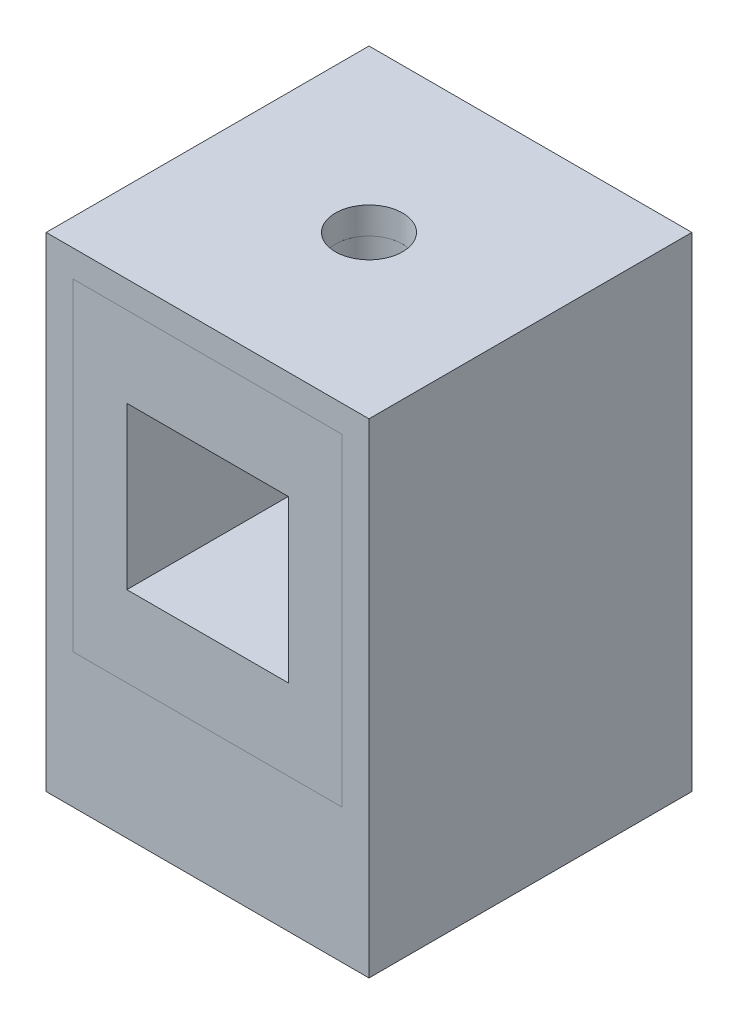
ISO-10303-21;
HEADER;
FILE_DESCRIPTION(('STEP AP214'),'2;1');
FILE_NAME('part.step','',(''),(''),'','','');
FILE_SCHEMA(('AUTOMOTIVE_DESIGN { 1 0 10303 214 1 1 1 1 }'));
ENDSEC;
DATA;
#1=APPLICATION_CONTEXT('core data for automotive mechanical design processes');
#2=APPLICATION_PROTOCOL_DEFINITION('international standard','automotive_design',2000,#1);
#3=PRODUCT_CONTEXT('',#1,'mechanical');
#4=PRODUCT('Part','Part','',(#3));
#5=PRODUCT_RELATED_PRODUCT_CATEGORY('part','',(#4));
#6=PRODUCT_DEFINITION_FORMATION('','',#4);
#7=PRODUCT_DEFINITION_CONTEXT('part definition',#1,'design');
#8=PRODUCT_DEFINITION('design','',#6,#7);
#9=PRODUCT_DEFINITION_SHAPE('','',#8);
#10=(LENGTH_UNIT() NAMED_UNIT(*) SI_UNIT(.MILLI.,.METRE.));
#11=(NAMED_UNIT(*) PLANE_ANGLE_UNIT() SI_UNIT($,.RADIAN.));
#12=(NAMED_UNIT(*) SI_UNIT($,.STERADIAN.) SOLID_ANGLE_UNIT());
#13=UNCERTAINTY_MEASURE_WITH_UNIT(LENGTH_MEASURE(1.E-05),#10,'distance_accuracy_value','');
#14=(GEOMETRIC_REPRESENTATION_CONTEXT(3) GLOBAL_UNCERTAINTY_ASSIGNED_CONTEXT((#13)) GLOBAL_UNIT_ASSIGNED_CONTEXT((#10,
#11,#12)) REPRESENTATION_CONTEXT('',''));
#15=CARTESIAN_POINT('',(0.,0.,0.));
#16=DIRECTION('',(0.,0.,1.));
#17=DIRECTION('',(1.,0.,0.));
#18=AXIS2_PLACEMENT_3D('',#15,#16,#17);
#19=CARTESIAN_POINT('',(-152.4,-457.2,-127.));
#20=DIRECTION('',(0.,0.,-1.));
#21=DIRECTION('',(-1.,0.,0.));
#22=AXIS2_PLACEMENT_3D('',#19,#20,#21);
#23=PLANE('',#22);
#24=DIRECTION('',(0.,-1.,0.));
#25=VECTOR('',#24,1.);
#26=CARTESIAN_POINT('',(-127.,-25.4,-127.));
#27=LINE('',#26,#25);
#28=CARTESIAN_POINT('',(-127.,-25.4,-127.00000000001));
#29=VERTEX_POINT('',#28);
#30=CARTESIAN_POINT('',(-127.,-330.2,-127.00000000001));
#31=VERTEX_POINT('',#30);
#32=EDGE_CURVE('E12',#29,#31,#27,.T.);
#33=ORIENTED_EDGE('',*,*,#32,.F.);
#34=DIRECTION('',(-1.,0.,0.));
#35=VECTOR('',#34,1.);
#36=CARTESIAN_POINT('',(-127.,-25.4,-127.));
#37=LINE('',#36,#35);
#38=CARTESIAN_POINT('',(127.,-25.4,-127.00000000001));
#39=VERTEX_POINT('',#38);
#40=EDGE_CURVE('E168',#39,#29,#37,.T.);
#41=ORIENTED_EDGE('',*,*,#40,.F.);
#42=DIRECTION('',(0.,1.,0.));
#43=VECTOR('',#42,1.);
#44=CARTESIAN_POINT('',(127.,-25.4,-127.));
#45=LINE('',#44,#43);
#46=CARTESIAN_POINT('',(127.,-330.2,-127.00000000001));
#47=VERTEX_POINT('',#46);
#48=EDGE_CURVE('E50',#47,#39,#45,.T.);
#49=ORIENTED_EDGE('',*,*,#48,.F.);
#50=DIRECTION('',(1.,0.,0.));
#51=VECTOR('',#50,1.);
#52=CARTESIAN_POINT('',(-127.,-330.2,-127.));
#53=LINE('',#52,#51);
#54=EDGE_CURVE('E55',#31,#47,#53,.T.);
#55=ORIENTED_EDGE('',*,*,#54,.F.);
#56=EDGE_LOOP('',(#33,#41,#49,#55));
#57=FACE_BOUND('',#56,.T.);
#58=ADVANCED_FACE('F47',(#57),#23,.T.);
#59=CARTESIAN_POINT('',(127.,-25.4,-500000.));
#60=DIRECTION('',(1.,0.,0.));
#61=DIRECTION('',(0.,0.,-1.));
#62=AXIS2_PLACEMENT_3D('',#59,#60,#61);
#63=PLANE('',#62);
#64=DIRECTION('',(0.,0.,1.));
#65=VECTOR('',#64,1.);
#66=CARTESIAN_POINT('',(127.,-330.2,-500000.));
#67=LINE('',#66,#65);
#68=CARTESIAN_POINT('',(127.,-330.2,152.4));
#69=VERTEX_POINT('',#68);
#70=EDGE_CURVE('E169',#47,#69,#67,.T.);
#71=ORIENTED_EDGE('',*,*,#70,.F.);
#72=ORIENTED_EDGE('',*,*,#48,.T.);
#73=DIRECTION('',(0.,0.,1.));
#74=VECTOR('',#73,1.);
#75=CARTESIAN_POINT('',(127.,-25.4,-500000.));
#76=LINE('',#75,#74);
#77=CARTESIAN_POINT('',(127.,-25.4,152.4));
#78=VERTEX_POINT('',#77);
#79=EDGE_CURVE('E171',#39,#78,#76,.T.);
#80=ORIENTED_EDGE('',*,*,#79,.T.);
#81=DIRECTION('',(0.,1.,0.));
#82=VECTOR('',#81,1.);
#83=CARTESIAN_POINT('',(127.,-25.4,152.4));
#84=LINE('',#83,#82);
#85=EDGE_CURVE('E157',#69,#78,#84,.T.);
#86=ORIENTED_EDGE('',*,*,#85,.F.);
#87=EDGE_LOOP('',(#71,#72,#80,#86));
#88=FACE_BOUND('',#87,.T.);
#89=ADVANCED_FACE('F179',(#88),#63,.T.);
#90=CARTESIAN_POINT('',(-127.,-330.2,152.4));
#91=DIRECTION('',(0.,0.,1.));
#92=DIRECTION('',(1.,0.,0.));
#93=AXIS2_PLACEMENT_3D('',#90,#91,#92);
#94=PLANE('',#93);
#95=DIRECTION('',(0.,-1.,0.));
#96=VECTOR('',#95,1.);
#97=CARTESIAN_POINT('',(-76.2,-254.,152.4));
#98=LINE('',#97,#96);
#99=CARTESIAN_POINT('',(-76.2,-101.6,152.4));
#100=VERTEX_POINT('',#99);
#101=CARTESIAN_POINT('',(-76.2,-254.,152.4));
#102=VERTEX_POINT('',#101);
#103=EDGE_CURVE('E63',#100,#102,#98,.T.);
#104=ORIENTED_EDGE('',*,*,#103,.F.);
#105=DIRECTION('',(-1.,0.,0.));
#106=VECTOR('',#105,1.);
#107=CARTESIAN_POINT('',(-76.2,-101.6,152.4));
#108=LINE('',#107,#106);
#109=CARTESIAN_POINT('',(76.2,-101.6,152.4));
#110=VERTEX_POINT('',#109);
#111=EDGE_CURVE('E132',#110,#100,#108,.T.);
#112=ORIENTED_EDGE('',*,*,#111,.F.);
#113=DIRECTION('',(0.,1.,0.));
#114=VECTOR('',#113,1.);
#115=CARTESIAN_POINT('',(76.2,-254.,152.4));
#116=LINE('',#115,#114);
#117=CARTESIAN_POINT('',(76.2,-254.,152.4));
#118=VERTEX_POINT('',#117);
#119=EDGE_CURVE('E135',#118,#110,#116,.T.);
#120=ORIENTED_EDGE('',*,*,#119,.F.);
#121=DIRECTION('',(1.,0.,0.));
#122=VECTOR('',#121,1.);
#123=CARTESIAN_POINT('',(-76.2,-254.,152.4));
#124=LINE('',#123,#122);
#125=EDGE_CURVE('E144',#102,#118,#124,.T.);
#126=ORIENTED_EDGE('',*,*,#125,.F.);
#127=EDGE_LOOP('',(#104,#112,#120,#126));
#128=FACE_BOUND('',#127,.T.);
#129=DIRECTION('',(0.,-1.,0.));
#130=VECTOR('',#129,1.);
#131=CARTESIAN_POINT('',(-127.,-25.4,152.4));
#132=LINE('',#131,#130);
#133=CARTESIAN_POINT('',(-127.,-25.4,152.4));
#134=VERTEX_POINT('',#133);
#135=CARTESIAN_POINT('',(-127.,-330.2,152.4));
#136=VERTEX_POINT('',#135);
#137=EDGE_CURVE('E150',#134,#136,#132,.T.);
#138=ORIENTED_EDGE('',*,*,#137,.T.);
#139=DIRECTION('',(1.,0.,0.));
#140=VECTOR('',#139,1.);
#141=CARTESIAN_POINT('',(-127.,-330.2,152.4));
#142=LINE('',#141,#140);
#143=EDGE_CURVE('E154',#136,#69,#142,.T.);
#144=ORIENTED_EDGE('',*,*,#143,.T.);
#145=ORIENTED_EDGE('',*,*,#85,.T.);
#146=DIRECTION('',(-1.,0.,0.));
#147=VECTOR('',#146,1.);
#148=CARTESIAN_POINT('',(-127.,-25.4,152.4));
#149=LINE('',#148,#147);
#150=EDGE_CURVE('E160',#78,#134,#149,.T.);
#151=ORIENTED_EDGE('',*,*,#150,.T.);
#152=EDGE_LOOP('',(#138,#144,#145,#151));
#153=FACE_BOUND('',#152,.T.);
#154=ADVANCED_FACE('F186',(#128,#153),#94,.T.);
#155=CARTESIAN_POINT('',(-127.,-25.4,-500000.));
#156=DIRECTION('',(0.,1.,0.));
#157=DIRECTION('',(0.,0.,1.));
#158=AXIS2_PLACEMENT_3D('',#155,#156,#157);
#159=PLANE('',#158);
#160=CARTESIAN_POINT('',(0.,-25.4,0.));
#161=DIRECTION('',(0.,1.,0.));
#162=DIRECTION('',(0.,0.,1.));
#163=AXIS2_PLACEMENT_3D('',#160,#161,#162);
#164=CIRCLE('',#163,31.75);
#165=CARTESIAN_POINT('',(0.,-25.4,31.75));
#166=VERTEX_POINT('',#165);
#167=EDGE_CURVE('E138',#166,#166,#164,.T.);
#168=ORIENTED_EDGE('',*,*,#167,.F.);
#169=EDGE_LOOP('',(#168));
#170=FACE_BOUND('',#169,.T.);
#171=ORIENTED_EDGE('',*,*,#79,.F.);
#172=ORIENTED_EDGE('',*,*,#40,.T.);
#173=DIRECTION('',(0.,0.,1.));
#174=VECTOR('',#173,1.);
#175=CARTESIAN_POINT('',(-127.,-25.4,-500000.));
#176=LINE('',#175,#174);
#177=EDGE_CURVE('E163',#29,#134,#176,.T.);
#178=ORIENTED_EDGE('',*,*,#177,.T.);
#179=ORIENTED_EDGE('',*,*,#150,.F.);
#180=EDGE_LOOP('',(#171,#172,#178,#179));
#181=FACE_BOUND('',#180,.T.);
#182=ADVANCED_FACE('F183',(#170,#181),#159,.T.);
#183=CARTESIAN_POINT('',(-127.,-25.4,-500000.));
#184=DIRECTION('',(-1.,0.,0.));
#185=DIRECTION('',(0.,0.,1.));
#186=AXIS2_PLACEMENT_3D('',#183,#184,#185);
#187=PLANE('',#186);
#188=ORIENTED_EDGE('',*,*,#177,.F.);
#189=ORIENTED_EDGE('',*,*,#32,.T.);
#190=DIRECTION('',(0.,0.,1.));
#191=VECTOR('',#190,1.);
#192=CARTESIAN_POINT('',(-127.,-330.2,-500000.));
#193=LINE('',#192,#191);
#194=EDGE_CURVE('E166',#31,#136,#193,.T.);
#195=ORIENTED_EDGE('',*,*,#194,.T.);
#196=ORIENTED_EDGE('',*,*,#137,.F.);
#197=EDGE_LOOP('',(#188,#189,#195,#196));
#198=FACE_BOUND('',#197,.T.);
#199=ADVANCED_FACE('F192',(#198),#187,.T.);
#200=CARTESIAN_POINT('',(-127.,-330.2,-500000.));
#201=DIRECTION('',(0.,-1.,0.));
#202=DIRECTION('',(0.,0.,-1.));
#203=AXIS2_PLACEMENT_3D('',#200,#201,#202);
#204=PLANE('',#203);
#205=ORIENTED_EDGE('',*,*,#194,.F.);
#206=ORIENTED_EDGE('',*,*,#54,.T.);
#207=ORIENTED_EDGE('',*,*,#70,.T.);
#208=ORIENTED_EDGE('',*,*,#143,.F.);
#209=EDGE_LOOP('',(#205,#206,#207,#208));
#210=FACE_BOUND('',#209,.T.);
#211=ADVANCED_FACE('F190',(#210),#204,.T.);
#212=CARTESIAN_POINT('',(-76.2,-254.,-101.6));
#213=DIRECTION('',(-1.,0.,0.));
#214=DIRECTION('',(0.,0.,1.));
#215=AXIS2_PLACEMENT_3D('',#212,#213,#214);
#216=PLANE('',#215);
#217=ORIENTED_EDGE('',*,*,#103,.T.);
#218=DIRECTION('',(0.,0.,1.));
#219=VECTOR('',#218,1.);
#220=CARTESIAN_POINT('',(-76.2,-254.,-101.6));
#221=LINE('',#220,#219);
#222=CARTESIAN_POINT('',(-76.2,-254.,-101.6));
#223=VERTEX_POINT('',#222);
#224=EDGE_CURVE('E110',#223,#102,#221,.T.);
#225=ORIENTED_EDGE('',*,*,#224,.F.);
#226=DIRECTION('',(0.,-1.,0.));
#227=VECTOR('',#226,1.);
#228=CARTESIAN_POINT('',(-76.2,-254.,-101.6));
#229=LINE('',#228,#227);
#230=CARTESIAN_POINT('',(-76.2,-101.6,-101.6));
#231=VERTEX_POINT('',#230);
#232=EDGE_CURVE('E114',#231,#223,#229,.T.);
#233=ORIENTED_EDGE('',*,*,#232,.F.);
#234=DIRECTION('',(0.,0.,1.));
#235=VECTOR('',#234,1.);
#236=CARTESIAN_POINT('',(-76.2,-101.6,-101.6));
#237=LINE('',#236,#235);
#238=EDGE_CURVE('E148',#231,#100,#237,.T.);
#239=ORIENTED_EDGE('',*,*,#238,.T.);
#240=EDGE_LOOP('',(#217,#225,#233,#239));
#241=FACE_BOUND('',#240,.T.);
#242=ADVANCED_FACE('F112',(#241),#216,.F.);
#243=CARTESIAN_POINT('',(-76.2,-101.6,-101.6));
#244=DIRECTION('',(0.,1.,0.));
#245=DIRECTION('',(0.,0.,1.));
#246=AXIS2_PLACEMENT_3D('',#243,#244,#245);
#247=PLANE('',#246);
#248=CARTESIAN_POINT('',(0.,-101.6,0.));
#249=DIRECTION('',(0.,1.,0.));
#250=DIRECTION('',(0.,0.,1.));
#251=AXIS2_PLACEMENT_3D('',#248,#249,#250);
#252=CIRCLE('',#251,31.75);
#253=CARTESIAN_POINT('',(0.,-101.6,31.75));
#254=VERTEX_POINT('',#253);
#255=EDGE_CURVE('E236',#254,#254,#252,.T.);
#256=ORIENTED_EDGE('',*,*,#255,.T.);
#257=EDGE_LOOP('',(#256));
#258=FACE_BOUND('',#257,.T.);
#259=ORIENTED_EDGE('',*,*,#111,.T.);
#260=ORIENTED_EDGE('',*,*,#238,.F.);
#261=DIRECTION('',(-1.,0.,0.));
#262=VECTOR('',#261,1.);
#263=CARTESIAN_POINT('',(-76.2,-101.6,-101.6));
#264=LINE('',#263,#262);
#265=CARTESIAN_POINT('',(76.2,-101.6,-101.6));
#266=VERTEX_POINT('',#265);
#267=EDGE_CURVE('E120',#266,#231,#264,.T.);
#268=ORIENTED_EDGE('',*,*,#267,.F.);
#269=DIRECTION('',(0.,0.,1.));
#270=VECTOR('',#269,1.);
#271=CARTESIAN_POINT('',(76.2,-101.6,-101.6));
#272=LINE('',#271,#270);
#273=EDGE_CURVE('E151',#266,#110,#272,.T.);
#274=ORIENTED_EDGE('',*,*,#273,.T.);
#275=EDGE_LOOP('',(#259,#260,#268,#274));
#276=FACE_BOUND('',#275,.T.);
#277=ADVANCED_FACE('F214',(#258,#276),#247,.F.);
#278=CARTESIAN_POINT('',(76.2,-254.,-101.6));
#279=DIRECTION('',(1.,0.,0.));
#280=DIRECTION('',(0.,0.,-1.));
#281=AXIS2_PLACEMENT_3D('',#278,#279,#280);
#282=PLANE('',#281);
#283=ORIENTED_EDGE('',*,*,#119,.T.);
#284=ORIENTED_EDGE('',*,*,#273,.F.);
#285=DIRECTION('',(0.,1.,0.));
#286=VECTOR('',#285,1.);
#287=CARTESIAN_POINT('',(76.2,-254.,-101.6));
#288=LINE('',#287,#286);
#289=CARTESIAN_POINT('',(76.2,-254.,-101.6));
#290=VERTEX_POINT('',#289);
#291=EDGE_CURVE('E128',#290,#266,#288,.T.);
#292=ORIENTED_EDGE('',*,*,#291,.F.);
#293=DIRECTION('',(0.,0.,1.));
#294=VECTOR('',#293,1.);
#295=CARTESIAN_POINT('',(76.2,-254.,-101.6));
#296=LINE('',#295,#294);
#297=EDGE_CURVE('E119',#290,#118,#296,.T.);
#298=ORIENTED_EDGE('',*,*,#297,.T.);
#299=EDGE_LOOP('',(#283,#284,#292,#298));
#300=FACE_BOUND('',#299,.T.);
#301=ADVANCED_FACE('F217',(#300),#282,.F.);
#302=CARTESIAN_POINT('',(-76.2,-254.,-101.6));
#303=DIRECTION('',(0.,-1.,0.));
#304=DIRECTION('',(0.,0.,-1.));
#305=AXIS2_PLACEMENT_3D('',#302,#303,#304);
#306=PLANE('',#305);
#307=ORIENTED_EDGE('',*,*,#125,.T.);
#308=ORIENTED_EDGE('',*,*,#297,.F.);
#309=DIRECTION('',(1.,0.,0.));
#310=VECTOR('',#309,1.);
#311=CARTESIAN_POINT('',(-76.2,-254.,-101.6));
#312=LINE('',#311,#310);
#313=EDGE_CURVE('E123',#223,#290,#312,.T.);
#314=ORIENTED_EDGE('',*,*,#313,.F.);
#315=ORIENTED_EDGE('',*,*,#224,.T.);
#316=EDGE_LOOP('',(#307,#308,#314,#315));
#317=FACE_BOUND('',#316,.T.);
#318=ADVANCED_FACE('F124',(#317),#306,.F.);
#319=CARTESIAN_POINT('',(-76.2,-101.6,-101.6));
#320=DIRECTION('',(0.,0.,-1.));
#321=DIRECTION('',(-1.,0.,0.));
#322=AXIS2_PLACEMENT_3D('',#319,#320,#321);
#323=PLANE('',#322);
#324=ORIENTED_EDGE('',*,*,#232,.T.);
#325=ORIENTED_EDGE('',*,*,#313,.T.);
#326=ORIENTED_EDGE('',*,*,#291,.T.);
#327=ORIENTED_EDGE('',*,*,#267,.T.);
#328=EDGE_LOOP('',(#324,#325,#326,#327));
#329=FACE_BOUND('',#328,.T.);
#330=ADVANCED_FACE('F130',(#329),#323,.F.);
#331=CARTESIAN_POINT('',(0.,-343.802561210692,0.));
#332=DIRECTION('',(0.,1.,0.));
#333=DIRECTION('',(0.,0.,1.));
#334=AXIS2_PLACEMENT_3D('',#331,#332,#333);
#335=CYLINDRICAL_SURFACE('',#334,31.75);
#336=ORIENTED_EDGE('',*,*,#167,.T.);
#337=EDGE_LOOP('',(#336));
#338=FACE_BOUND('',#337,.T.);
#339=ORIENTED_EDGE('',*,*,#255,.F.);
#340=EDGE_LOOP('',(#339));
#341=FACE_BOUND('',#340,.T.);
#342=ADVANCED_FACE('F226',(#338,#341),#335,.F.);
#343=CLOSED_SHELL('',(#58,#89,#154,#182,#199,#211,#242,#277,#301,#318,#330,#342));
#344=MANIFOLD_SOLID_BREP('B2',#343);
#345=CARTESIAN_POINT('',(-152.4,-457.2,-152.4));
#346=DIRECTION('',(-1.,0.,0.));
#347=DIRECTION('',(0.,0.,1.));
#348=AXIS2_PLACEMENT_3D('',#345,#346,#347);
#349=PLANE('',#348);
#350=DIRECTION('',(0.,0.,1.));
#351=VECTOR('',#350,1.);
#352=CARTESIAN_POINT('',(-152.4,0.,-152.4));
#353=LINE('',#352,#351);
#354=CARTESIAN_POINT('',(-152.4,0.,-152.4));
#355=VERTEX_POINT('',#354);
#356=CARTESIAN_POINT('',(-152.4,0.,152.4));
#357=VERTEX_POINT('',#356);
#358=EDGE_CURVE('E418',#355,#357,#353,.T.);
#359=ORIENTED_EDGE('',*,*,#358,.F.);
#360=DIRECTION('',(0.,1.,0.));
#361=VECTOR('',#360,1.);
#362=CARTESIAN_POINT('',(-152.4,-457.2,-152.4));
#363=LINE('',#362,#361);
#364=CARTESIAN_POINT('',(-152.4,-457.2,-152.4));
#365=VERTEX_POINT('',#364);
#366=EDGE_CURVE('E45',#365,#355,#363,.T.);
#367=ORIENTED_EDGE('',*,*,#366,.F.);
#368=DIRECTION('',(0.,0.,1.));
#369=VECTOR('',#368,1.);
#370=CARTESIAN_POINT('',(-152.4,-457.2,-152.4));
#371=LINE('',#370,#369);
#372=CARTESIAN_POINT('',(-152.4,-457.2,152.4));
#373=VERTEX_POINT('',#372);
#374=EDGE_CURVE('E419',#365,#373,#371,.T.);
#375=ORIENTED_EDGE('',*,*,#374,.T.);
#376=DIRECTION('',(0.,1.,0.));
#377=VECTOR('',#376,1.);
#378=CARTESIAN_POINT('',(-152.4,-457.2,152.4));
#379=LINE('',#378,#377);
#380=EDGE_CURVE('E356',#373,#357,#379,.T.);
#381=ORIENTED_EDGE('',*,*,#380,.T.);
#382=EDGE_LOOP('',(#359,#367,#375,#381));
#383=FACE_BOUND('',#382,.T.);
#384=ADVANCED_FACE('F307',(#383),#349,.T.);
#385=CARTESIAN_POINT('',(-152.4,-457.2,-152.4));
#386=DIRECTION('',(0.,0.,-1.));
#387=DIRECTION('',(-1.,0.,0.));
#388=AXIS2_PLACEMENT_3D('',#385,#386,#387);
#389=PLANE('',#388);
#390=DIRECTION('',(-1.,0.,0.));
#391=VECTOR('',#390,1.);
#392=CARTESIAN_POINT('',(-152.4,0.,-152.4));
#393=LINE('',#392,#391);
#394=CARTESIAN_POINT('',(152.4,0.,-152.4));
#395=VERTEX_POINT('',#394);
#396=EDGE_CURVE('E422',#395,#355,#393,.T.);
#397=ORIENTED_EDGE('',*,*,#396,.F.);
#398=DIRECTION('',(0.,1.,0.));
#399=VECTOR('',#398,1.);
#400=CARTESIAN_POINT('',(152.4,-457.2,-152.4));
#401=LINE('',#400,#399);
#402=CARTESIAN_POINT('',(152.4,-457.2,-152.4));
#403=VERTEX_POINT('',#402);
#404=EDGE_CURVE('E315',#403,#395,#401,.T.);
#405=ORIENTED_EDGE('',*,*,#404,.F.);
#406=DIRECTION('',(-1.,0.,0.));
#407=VECTOR('',#406,1.);
#408=CARTESIAN_POINT('',(-152.4,-457.2,-152.4));
#409=LINE('',#408,#407);
#410=EDGE_CURVE('E427',#403,#365,#409,.T.);
#411=ORIENTED_EDGE('',*,*,#410,.T.);
#412=ORIENTED_EDGE('',*,*,#366,.T.);
#413=EDGE_LOOP('',(#397,#405,#411,#412));
#414=FACE_BOUND('',#413,.T.);
#415=ADVANCED_FACE('F445',(#414),#389,.T.);
#416=CARTESIAN_POINT('',(152.4,-457.2,-152.4));
#417=DIRECTION('',(1.,0.,0.));
#418=DIRECTION('',(0.,0.,-1.));
#419=AXIS2_PLACEMENT_3D('',#416,#417,#418);
#420=PLANE('',#419);
#421=DIRECTION('',(0.,0.,-1.));
#422=VECTOR('',#421,1.);
#423=CARTESIAN_POINT('',(152.4,0.,-152.4));
#424=LINE('',#423,#422);
#425=CARTESIAN_POINT('',(152.4,0.,152.4));
#426=VERTEX_POINT('',#425);
#427=EDGE_CURVE('E434',#426,#395,#424,.T.);
#428=ORIENTED_EDGE('',*,*,#427,.F.);
#429=DIRECTION('',(0.,1.,0.));
#430=VECTOR('',#429,1.);
#431=CARTESIAN_POINT('',(152.4,-457.2,152.4));
#432=LINE('',#431,#430);
#433=CARTESIAN_POINT('',(152.4,-457.2,152.4));
#434=VERTEX_POINT('',#433);
#435=EDGE_CURVE('E440',#434,#426,#432,.T.);
#436=ORIENTED_EDGE('',*,*,#435,.F.);
#437=DIRECTION('',(0.,0.,-1.));
#438=VECTOR('',#437,1.);
#439=CARTESIAN_POINT('',(152.4,-457.2,-152.4));
#440=LINE('',#439,#438);
#441=EDGE_CURVE('E424',#434,#403,#440,.T.);
#442=ORIENTED_EDGE('',*,*,#441,.T.);
#443=ORIENTED_EDGE('',*,*,#404,.T.);
#444=EDGE_LOOP('',(#428,#436,#442,#443));
#445=FACE_BOUND('',#444,.T.);
#446=ADVANCED_FACE('F449',(#445),#420,.T.);
#447=CARTESIAN_POINT('',(-152.4,-457.2,152.4));
#448=DIRECTION('',(0.,0.,1.));
#449=DIRECTION('',(1.,0.,0.));
#450=AXIS2_PLACEMENT_3D('',#447,#448,#449);
#451=PLANE('',#450);
#452=DIRECTION('',(1.,0.,0.));
#453=VECTOR('',#452,1.);
#454=CARTESIAN_POINT('',(-127.,-330.2,152.4));
#455=LINE('',#454,#453);
#456=CARTESIAN_POINT('',(-127.,-330.2,152.4));
#457=VERTEX_POINT('',#456);
#458=CARTESIAN_POINT('',(127.,-330.2,152.4));
#459=VERTEX_POINT('',#458);
#460=EDGE_CURVE('E397',#457,#459,#455,.T.);
#461=ORIENTED_EDGE('',*,*,#460,.F.);
#462=DIRECTION('',(0.,-1.,0.));
#463=VECTOR('',#462,1.);
#464=CARTESIAN_POINT('',(-127.,-25.4,152.4));
#465=LINE('',#464,#463);
#466=CARTESIAN_POINT('',(-127.,-25.4,152.4));
#467=VERTEX_POINT('',#466);
#468=EDGE_CURVE('E408',#467,#457,#465,.T.);
#469=ORIENTED_EDGE('',*,*,#468,.F.);
#470=DIRECTION('',(-1.,0.,0.));
#471=VECTOR('',#470,1.);
#472=CARTESIAN_POINT('',(-127.,-25.4,152.4));
#473=LINE('',#472,#471);
#474=CARTESIAN_POINT('',(127.,-25.4,152.4));
#475=VERTEX_POINT('',#474);
#476=EDGE_CURVE('E323',#475,#467,#473,.T.);
#477=ORIENTED_EDGE('',*,*,#476,.F.);
#478=DIRECTION('',(0.,1.,0.));
#479=VECTOR('',#478,1.);
#480=CARTESIAN_POINT('',(127.,-25.4,152.4));
#481=LINE('',#480,#479);
#482=EDGE_CURVE('E404',#459,#475,#481,.T.);
#483=ORIENTED_EDGE('',*,*,#482,.F.);
#484=EDGE_LOOP('',(#461,#469,#477,#483));
#485=FACE_BOUND('',#484,.T.);
#486=DIRECTION('',(1.,0.,0.));
#487=VECTOR('',#486,1.);
#488=CARTESIAN_POINT('',(-152.4,0.,152.4));
#489=LINE('',#488,#487);
#490=EDGE_CURVE('E431',#357,#426,#489,.T.);
#491=ORIENTED_EDGE('',*,*,#490,.F.);
#492=ORIENTED_EDGE('',*,*,#380,.F.);
#493=DIRECTION('',(1.,0.,0.));
#494=VECTOR('',#493,1.);
#495=CARTESIAN_POINT('',(-152.4,-457.2,152.4));
#496=LINE('',#495,#494);
#497=EDGE_CURVE('E421',#373,#434,#496,.T.);
#498=ORIENTED_EDGE('',*,*,#497,.T.);
#499=ORIENTED_EDGE('',*,*,#435,.T.);
#500=EDGE_LOOP('',(#491,#492,#498,#499));
#501=FACE_BOUND('',#500,.T.);
#502=ADVANCED_FACE('F441',(#485,#501),#451,.T.);
#503=CARTESIAN_POINT('',(-152.4,-457.2,152.4));
#504=DIRECTION('',(0.,1.,0.));
#505=DIRECTION('',(0.,0.,1.));
#506=AXIS2_PLACEMENT_3D('',#503,#504,#505);
#507=PLANE('',#506);
#508=ORIENTED_EDGE('',*,*,#374,.F.);
#509=ORIENTED_EDGE('',*,*,#410,.F.);
#510=ORIENTED_EDGE('',*,*,#441,.F.);
#511=ORIENTED_EDGE('',*,*,#497,.F.);
#512=EDGE_LOOP('',(#508,#509,#510,#511));
#513=FACE_BOUND('',#512,.T.);
#514=ADVANCED_FACE('F451',(#513),#507,.F.);
#515=CARTESIAN_POINT('',(-152.4,0.,152.4));
#516=DIRECTION('',(0.,1.,0.));
#517=DIRECTION('',(0.,0.,1.));
#518=AXIS2_PLACEMENT_3D('',#515,#516,#517);
#519=PLANE('',#518);
#520=CARTESIAN_POINT('',(0.,0.,0.));
#521=DIRECTION('',(0.,1.,0.));
#522=DIRECTION('',(0.,0.,1.));
#523=AXIS2_PLACEMENT_3D('',#520,#521,#522);
#524=CIRCLE('',#523,31.75);
#525=CARTESIAN_POINT('',(0.,0.,31.75));
#526=VERTEX_POINT('',#525);
#527=EDGE_CURVE('E545',#526,#526,#524,.T.);
#528=ORIENTED_EDGE('',*,*,#527,.F.);
#529=EDGE_LOOP('',(#528));
#530=FACE_BOUND('',#529,.T.);
#531=ORIENTED_EDGE('',*,*,#358,.T.);
#532=ORIENTED_EDGE('',*,*,#490,.T.);
#533=ORIENTED_EDGE('',*,*,#427,.T.);
#534=ORIENTED_EDGE('',*,*,#396,.T.);
#535=EDGE_LOOP('',(#531,#532,#533,#534));
#536=FACE_BOUND('',#535,.T.);
#537=ADVANCED_FACE('F444',(#530,#536),#519,.T.);
#538=CARTESIAN_POINT('',(-152.4,-457.2,-127.));
#539=DIRECTION('',(0.,0.,-1.));
#540=DIRECTION('',(-1.,0.,0.));
#541=AXIS2_PLACEMENT_3D('',#538,#539,#540);
#542=PLANE('',#541);
#543=DIRECTION('',(0.,-1.,0.));
#544=VECTOR('',#543,1.);
#545=CARTESIAN_POINT('',(-127.,-25.4,-127.));
#546=LINE('',#545,#544);
#547=CARTESIAN_POINT('',(-127.,-25.4,-127.));
#548=VERTEX_POINT('',#547);
#549=CARTESIAN_POINT('',(-127.,-330.2,-127.));
#550=VERTEX_POINT('',#549);
#551=EDGE_CURVE('E401',#548,#550,#546,.T.);
#552=ORIENTED_EDGE('',*,*,#551,.T.);
#553=DIRECTION('',(1.,0.,0.));
#554=VECTOR('',#553,1.);
#555=CARTESIAN_POINT('',(-127.,-330.2,-127.));
#556=LINE('',#555,#554);
#557=CARTESIAN_POINT('',(127.,-330.2,-127.));
#558=VERTEX_POINT('',#557);
#559=EDGE_CURVE('E394',#550,#558,#556,.T.);
#560=ORIENTED_EDGE('',*,*,#559,.T.);
#561=DIRECTION('',(0.,1.,0.));
#562=VECTOR('',#561,1.);
#563=CARTESIAN_POINT('',(127.,-25.4,-127.));
#564=LINE('',#563,#562);
#565=CARTESIAN_POINT('',(127.,-25.4,-127.));
#566=VERTEX_POINT('',#565);
#567=EDGE_CURVE('E381',#558,#566,#564,.T.);
#568=ORIENTED_EDGE('',*,*,#567,.T.);
#569=DIRECTION('',(-1.,0.,0.));
#570=VECTOR('',#569,1.);
#571=CARTESIAN_POINT('',(-127.,-25.4,-127.));
#572=LINE('',#571,#570);
#573=EDGE_CURVE('E413',#566,#548,#572,.T.);
#574=ORIENTED_EDGE('',*,*,#573,.T.);
#575=EDGE_LOOP('',(#552,#560,#568,#574));
#576=FACE_BOUND('',#575,.T.);
#577=ADVANCED_FACE('F400',(#576),#542,.F.);
#578=CARTESIAN_POINT('',(-127.,-330.2,-549.160683536058));
#579=DIRECTION('',(0.,-1.,0.));
#580=DIRECTION('',(0.,0.,-1.));
#581=AXIS2_PLACEMENT_3D('',#578,#579,#580);
#582=PLANE('',#581);
#583=DIRECTION('',(0.,0.,1.));
#584=VECTOR('',#583,1.);
#585=CARTESIAN_POINT('',(-127.,-330.2,-549.160683536058));
#586=LINE('',#585,#584);
#587=EDGE_CURVE('E411',#550,#457,#586,.T.);
#588=ORIENTED_EDGE('',*,*,#587,.T.);
#589=ORIENTED_EDGE('',*,*,#460,.T.);
#590=DIRECTION('',(0.,0.,1.));
#591=VECTOR('',#590,1.);
#592=CARTESIAN_POINT('',(127.,-330.2,-549.160683536058));
#593=LINE('',#592,#591);
#594=EDGE_CURVE('E385',#558,#459,#593,.T.);
#595=ORIENTED_EDGE('',*,*,#594,.F.);
#596=ORIENTED_EDGE('',*,*,#559,.F.);
#597=EDGE_LOOP('',(#588,#589,#595,#596));
#598=FACE_BOUND('',#597,.T.);
#599=ADVANCED_FACE('F393',(#598),#582,.F.);
#600=CARTESIAN_POINT('',(127.,-25.4,-549.160683536058));
#601=DIRECTION('',(1.,0.,0.));
#602=DIRECTION('',(0.,1.,0.));
#603=AXIS2_PLACEMENT_3D('',#600,#601,#602);
#604=PLANE('',#603);
#605=ORIENTED_EDGE('',*,*,#594,.T.);
#606=ORIENTED_EDGE('',*,*,#482,.T.);
#607=DIRECTION('',(0.,0.,1.));
#608=VECTOR('',#607,1.);
#609=CARTESIAN_POINT('',(127.,-25.4,-549.160683536058));
#610=LINE('',#609,#608);
#611=EDGE_CURVE('E387',#566,#475,#610,.T.);
#612=ORIENTED_EDGE('',*,*,#611,.F.);
#613=ORIENTED_EDGE('',*,*,#567,.F.);
#614=EDGE_LOOP('',(#605,#606,#612,#613));
#615=FACE_BOUND('',#614,.T.);
#616=ADVANCED_FACE('F383',(#615),#604,.F.);
#617=CARTESIAN_POINT('',(-127.,-25.4,-549.160683536058));
#618=DIRECTION('',(0.,1.,0.));
#619=DIRECTION('',(-1.,0.,0.));
#620=AXIS2_PLACEMENT_3D('',#617,#618,#619);
#621=PLANE('',#620);
#622=CARTESIAN_POINT('',(0.,-25.4,0.));
#623=DIRECTION('',(0.,1.,0.));
#624=DIRECTION('',(-1.,0.,0.));
#625=AXIS2_PLACEMENT_3D('',#622,#623,#624);
#626=CIRCLE('',#625,31.75);
#627=CARTESIAN_POINT('',(-31.75,-25.4,0.));
#628=VERTEX_POINT('',#627);
#629=EDGE_CURVE('E310',#628,#628,#626,.T.);
#630=ORIENTED_EDGE('',*,*,#629,.T.);
#631=EDGE_LOOP('',(#630));
#632=FACE_BOUND('',#631,.T.);
#633=ORIENTED_EDGE('',*,*,#611,.T.);
#634=ORIENTED_EDGE('',*,*,#476,.T.);
#635=DIRECTION('',(0.,0.,1.));
#636=VECTOR('',#635,1.);
#637=CARTESIAN_POINT('',(-127.,-25.4,-549.160683536058));
#638=LINE('',#637,#636);
#639=EDGE_CURVE('E412',#548,#467,#638,.T.);
#640=ORIENTED_EDGE('',*,*,#639,.F.);
#641=ORIENTED_EDGE('',*,*,#573,.F.);
#642=EDGE_LOOP('',(#633,#634,#640,#641));
#643=FACE_BOUND('',#642,.T.);
#644=ADVANCED_FACE('F504',(#632,#643),#621,.F.);
#645=CARTESIAN_POINT('',(-127.,-25.4,-549.160683536058));
#646=DIRECTION('',(-1.,0.,0.));
#647=DIRECTION('',(0.,0.,1.));
#648=AXIS2_PLACEMENT_3D('',#645,#646,#647);
#649=PLANE('',#648);
#650=ORIENTED_EDGE('',*,*,#639,.T.);
#651=ORIENTED_EDGE('',*,*,#468,.T.);
#652=ORIENTED_EDGE('',*,*,#587,.F.);
#653=ORIENTED_EDGE('',*,*,#551,.F.);
#654=EDGE_LOOP('',(#650,#651,#652,#653));
#655=FACE_BOUND('',#654,.T.);
#656=ADVANCED_FACE('F511',(#655),#649,.F.);
#657=CARTESIAN_POINT('',(0.,-343.802561210692,0.));
#658=DIRECTION('',(0.,1.,0.));
#659=DIRECTION('',(0.,0.,1.));
#660=AXIS2_PLACEMENT_3D('',#657,#658,#659);
#661=CYLINDRICAL_SURFACE('',#660,31.75);
#662=ORIENTED_EDGE('',*,*,#527,.T.);
#663=EDGE_LOOP('',(#662));
#664=FACE_BOUND('',#663,.T.);
#665=ORIENTED_EDGE('',*,*,#629,.F.);
#666=EDGE_LOOP('',(#665));
#667=FACE_BOUND('',#666,.T.);
#668=ADVANCED_FACE('F516',(#664,#667),#661,.F.);
#669=CLOSED_SHELL('',(#384,#415,#446,#502,#514,#537,#577,#599,#616,#644,#656,#668));
#670=MANIFOLD_SOLID_BREP('B6',#669);
#671=ADVANCED_BREP_SHAPE_REPRESENTATION('',(#18,#344,#670),#14);
#672=SHAPE_DEFINITION_REPRESENTATION(#9,#671);
ENDSEC;
END-ISO-10303-21;
